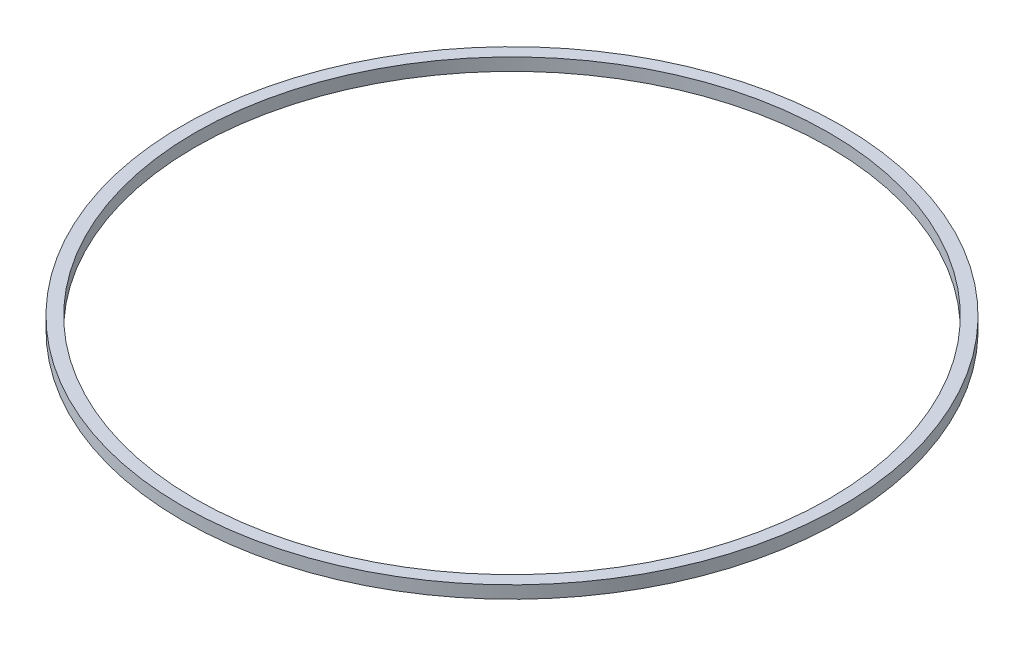
ISO-10303-21;
HEADER;
FILE_DESCRIPTION(('STEP AP214'),'2;1');
FILE_NAME('part.step','',(''),(''),'','','');
FILE_SCHEMA(('AUTOMOTIVE_DESIGN { 1 0 10303 214 1 1 1 1 }'));
ENDSEC;
DATA;
#1=APPLICATION_CONTEXT('core data for automotive mechanical design processes');
#2=APPLICATION_PROTOCOL_DEFINITION('international standard','automotive_design',2000,#1);
#3=PRODUCT_CONTEXT('',#1,'mechanical');
#4=PRODUCT('Part','Part','',(#3));
#5=PRODUCT_RELATED_PRODUCT_CATEGORY('part','',(#4));
#6=PRODUCT_DEFINITION_FORMATION('','',#4);
#7=PRODUCT_DEFINITION_CONTEXT('part definition',#1,'design');
#8=PRODUCT_DEFINITION('design','',#6,#7);
#9=PRODUCT_DEFINITION_SHAPE('','',#8);
#10=(LENGTH_UNIT() NAMED_UNIT(*) SI_UNIT(.MILLI.,.METRE.));
#11=(NAMED_UNIT(*) PLANE_ANGLE_UNIT() SI_UNIT($,.RADIAN.));
#12=(NAMED_UNIT(*) SI_UNIT($,.STERADIAN.) SOLID_ANGLE_UNIT());
#13=UNCERTAINTY_MEASURE_WITH_UNIT(LENGTH_MEASURE(1.E-05),#10,'distance_accuracy_value','');
#14=(GEOMETRIC_REPRESENTATION_CONTEXT(3) GLOBAL_UNCERTAINTY_ASSIGNED_CONTEXT((#13)) GLOBAL_UNIT_ASSIGNED_CONTEXT((#10,
#11,#12)) REPRESENTATION_CONTEXT('',''));
#15=CARTESIAN_POINT('',(0.,0.,0.));
#16=DIRECTION('',(0.,0.,1.));
#17=DIRECTION('',(1.,0.,0.));
#18=AXIS2_PLACEMENT_3D('',#15,#16,#17);
#19=CARTESIAN_POINT('',(0.,3.,0.));
#20=DIRECTION('',(0.,1.,0.));
#21=DIRECTION('',(0.,0.,1.));
#22=AXIS2_PLACEMENT_3D('',#19,#20,#21);
#23=PLANE('',#22);
#24=CARTESIAN_POINT('',(0.,3.,0.));
#25=DIRECTION('',(0.,1.,0.));
#26=DIRECTION('',(0.,0.,1.));
#27=AXIS2_PLACEMENT_3D('',#24,#25,#26);
#28=CIRCLE('',#27,79.);
#29=CARTESIAN_POINT('',(0.,3.,79.));
#30=VERTEX_POINT('',#29);
#31=EDGE_CURVE('E10',#30,#30,#28,.T.);
#32=ORIENTED_EDGE('',*,*,#31,.T.);
#33=EDGE_LOOP('',(#32));
#34=FACE_BOUND('',#33,.T.);
#35=CARTESIAN_POINT('',(0.,3.,0.));
#36=DIRECTION('',(0.,1.,0.));
#37=DIRECTION('',(0.,0.,1.));
#38=AXIS2_PLACEMENT_3D('',#35,#36,#37);
#39=CIRCLE('',#38,76.);
#40=CARTESIAN_POINT('',(0.,3.,76.));
#41=VERTEX_POINT('',#40);
#42=EDGE_CURVE('E42',#41,#41,#39,.T.);
#43=ORIENTED_EDGE('',*,*,#42,.F.);
#44=EDGE_LOOP('',(#43));
#45=FACE_BOUND('',#44,.T.);
#46=ADVANCED_FACE('F31',(#34,#45),#23,.T.);
#47=CARTESIAN_POINT('',(0.,0.,0.));
#48=DIRECTION('',(0.,1.,0.));
#49=DIRECTION('',(0.,0.,1.));
#50=AXIS2_PLACEMENT_3D('',#47,#48,#49);
#51=PLANE('',#50);
#52=CARTESIAN_POINT('',(0.,0.,0.));
#53=DIRECTION('',(0.,1.,0.));
#54=DIRECTION('',(0.,0.,1.));
#55=AXIS2_PLACEMENT_3D('',#52,#53,#54);
#56=CIRCLE('',#55,79.);
#57=CARTESIAN_POINT('',(0.,0.,79.));
#58=VERTEX_POINT('',#57);
#59=EDGE_CURVE('E35',#58,#58,#56,.T.);
#60=ORIENTED_EDGE('',*,*,#59,.F.);
#61=EDGE_LOOP('',(#60));
#62=FACE_BOUND('',#61,.T.);
#63=CARTESIAN_POINT('',(0.,0.,0.));
#64=DIRECTION('',(0.,1.,0.));
#65=DIRECTION('',(0.,0.,1.));
#66=AXIS2_PLACEMENT_3D('',#63,#64,#65);
#67=CIRCLE('',#66,76.);
#68=CARTESIAN_POINT('',(0.,0.,76.));
#69=VERTEX_POINT('',#68);
#70=EDGE_CURVE('E44',#69,#69,#67,.T.);
#71=ORIENTED_EDGE('',*,*,#70,.T.);
#72=EDGE_LOOP('',(#71));
#73=FACE_BOUND('',#72,.T.);
#74=ADVANCED_FACE('F54',(#62,#73),#51,.F.);
#75=CARTESIAN_POINT('',(0.,3.,0.));
#76=DIRECTION('',(0.,-1.,0.));
#77=DIRECTION('',(0.,0.,-1.));
#78=AXIS2_PLACEMENT_3D('',#75,#76,#77);
#79=CYLINDRICAL_SURFACE('',#78,79.);
#80=ORIENTED_EDGE('',*,*,#31,.F.);
#81=EDGE_LOOP('',(#80));
#82=FACE_BOUND('',#81,.T.);
#83=ORIENTED_EDGE('',*,*,#59,.T.);
#84=EDGE_LOOP('',(#83));
#85=FACE_BOUND('',#84,.T.);
#86=ADVANCED_FACE('F33',(#82,#85),#79,.T.);
#87=CARTESIAN_POINT('',(0.,3.,0.));
#88=DIRECTION('',(0.,-1.,0.));
#89=DIRECTION('',(0.,0.,-1.));
#90=AXIS2_PLACEMENT_3D('',#87,#88,#89);
#91=CYLINDRICAL_SURFACE('',#90,76.);
#92=ORIENTED_EDGE('',*,*,#42,.T.);
#93=EDGE_LOOP('',(#92));
#94=FACE_BOUND('',#93,.T.);
#95=ORIENTED_EDGE('',*,*,#70,.F.);
#96=EDGE_LOOP('',(#95));
#97=FACE_BOUND('',#96,.T.);
#98=ADVANCED_FACE('F50',(#94,#97),#91,.F.);
#99=CLOSED_SHELL('',(#46,#74,#86,#98));
#100=MANIFOLD_SOLID_BREP('B2',#99);
#101=ADVANCED_BREP_SHAPE_REPRESENTATION('',(#18,#100),#14);
#102=SHAPE_DEFINITION_REPRESENTATION(#9,#101);
ENDSEC;
END-ISO-10303-21;
